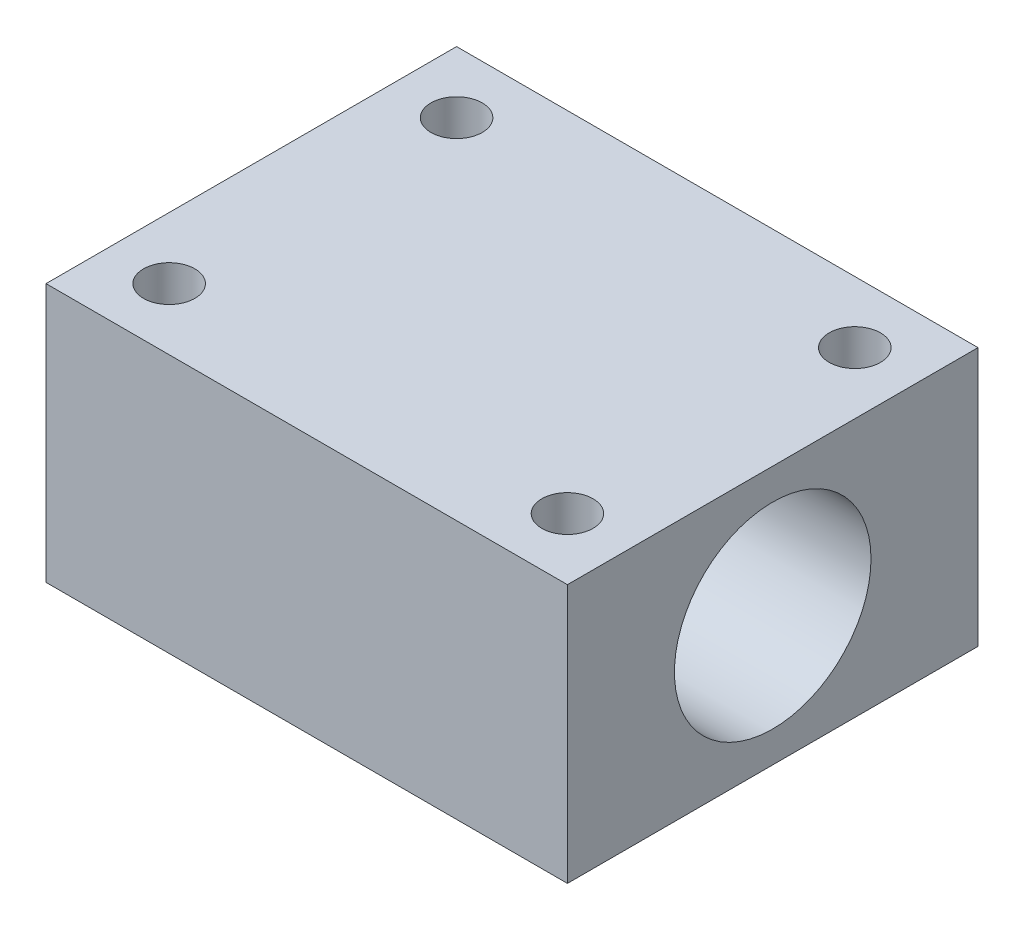
ISO-10303-21;
HEADER;
FILE_DESCRIPTION(('STEP AP214'),'2;1');
FILE_NAME('part.step','',(''),(''),'','','');
FILE_SCHEMA(('AUTOMOTIVE_DESIGN { 1 0 10303 214 1 1 1 1 }'));
ENDSEC;
DATA;
#1=APPLICATION_CONTEXT('core data for automotive mechanical design processes');
#2=APPLICATION_PROTOCOL_DEFINITION('international standard','automotive_design',2000,#1);
#3=PRODUCT_CONTEXT('',#1,'mechanical');
#4=PRODUCT('Part','Part','',(#3));
#5=PRODUCT_RELATED_PRODUCT_CATEGORY('part','',(#4));
#6=PRODUCT_DEFINITION_FORMATION('','',#4);
#7=PRODUCT_DEFINITION_CONTEXT('part definition',#1,'design');
#8=PRODUCT_DEFINITION('design','',#6,#7);
#9=PRODUCT_DEFINITION_SHAPE('','',#8);
#10=(LENGTH_UNIT() NAMED_UNIT(*) SI_UNIT(.MILLI.,.METRE.));
#11=(NAMED_UNIT(*) PLANE_ANGLE_UNIT() SI_UNIT($,.RADIAN.));
#12=(NAMED_UNIT(*) SI_UNIT($,.STERADIAN.) SOLID_ANGLE_UNIT());
#13=UNCERTAINTY_MEASURE_WITH_UNIT(LENGTH_MEASURE(1.E-05),#10,'distance_accuracy_value','');
#14=(GEOMETRIC_REPRESENTATION_CONTEXT(3) GLOBAL_UNCERTAINTY_ASSIGNED_CONTEXT((#13)) GLOBAL_UNIT_ASSIGNED_CONTEXT((#10,
#11,#12)) REPRESENTATION_CONTEXT('',''));
#15=CARTESIAN_POINT('',(0.,0.,0.));
#16=DIRECTION('',(0.,0.,1.));
#17=DIRECTION('',(1.,0.,0.));
#18=AXIS2_PLACEMENT_3D('',#15,#16,#17);
#19=CARTESIAN_POINT('',(44.998,-40.,0.));
#20=DIRECTION('',(0.,-1.,0.));
#21=DIRECTION('',(0.,0.,-1.));
#22=AXIS2_PLACEMENT_3D('',#19,#20,#21);
#23=PLANE('',#22);
#24=CARTESIAN_POINT('',(67.4,-40.,-7.));
#25=DIRECTION('',(0.,-1.,0.));
#26=DIRECTION('',(0.,0.,-1.));
#27=AXIS2_PLACEMENT_3D('',#24,#25,#26);
#28=CIRCLE('',#27,1.25);
#29=CARTESIAN_POINT('',(67.4,-40.,-8.25));
#30=VERTEX_POINT('',#29);
#31=EDGE_CURVE('E100',#30,#30,#28,.T.);
#32=ORIENTED_EDGE('',*,*,#31,.T.);
#33=EDGE_LOOP('',(#32));
#34=FACE_BOUND('',#33,.T.);
#35=CARTESIAN_POINT('',(48.,-40.,7.));
#36=DIRECTION('',(0.,-1.,0.));
#37=DIRECTION('',(0.,0.,-1.));
#38=AXIS2_PLACEMENT_3D('',#35,#36,#37);
#39=CIRCLE('',#38,1.25);
#40=CARTESIAN_POINT('',(48.,-40.,5.75));
#41=VERTEX_POINT('',#40);
#42=EDGE_CURVE('E196',#41,#41,#39,.T.);
#43=ORIENTED_EDGE('',*,*,#42,.T.);
#44=EDGE_LOOP('',(#43));
#45=FACE_BOUND('',#44,.T.);
#46=DIRECTION('',(1.,0.,0.));
#47=VECTOR('',#46,1.);
#48=CARTESIAN_POINT('',(44.998,-40.,-10.));
#49=LINE('',#48,#47);
#50=CARTESIAN_POINT('',(45.,-40.,-10.));
#51=VERTEX_POINT('',#50);
#52=CARTESIAN_POINT('',(70.4,-40.,-10.));
#53=VERTEX_POINT('',#52);
#54=EDGE_CURVE('E68',#51,#53,#49,.T.);
#55=ORIENTED_EDGE('',*,*,#54,.F.);
#56=DIRECTION('',(0.,0.,1.));
#57=VECTOR('',#56,1.);
#58=CARTESIAN_POINT('',(45.,-40.,0.));
#59=LINE('',#58,#57);
#60=CARTESIAN_POINT('',(45.,-40.,10.));
#61=VERTEX_POINT('',#60);
#62=EDGE_CURVE('E39',#51,#61,#59,.T.);
#63=ORIENTED_EDGE('',*,*,#62,.T.);
#64=DIRECTION('',(1.,0.,0.));
#65=VECTOR('',#64,1.);
#66=CARTESIAN_POINT('',(44.998,-40.,10.));
#67=LINE('',#66,#65);
#68=CARTESIAN_POINT('',(70.4,-40.,10.));
#69=VERTEX_POINT('',#68);
#70=EDGE_CURVE('E75',#61,#69,#67,.T.);
#71=ORIENTED_EDGE('',*,*,#70,.T.);
#72=DIRECTION('',(0.,0.,-1.));
#73=VECTOR('',#72,1.);
#74=CARTESIAN_POINT('',(70.4,-40.,0.));
#75=LINE('',#74,#73);
#76=EDGE_CURVE('E78',#69,#53,#75,.T.);
#77=ORIENTED_EDGE('',*,*,#76,.T.);
#78=EDGE_LOOP('',(#55,#63,#71,#77));
#79=FACE_BOUND('',#78,.T.);
#80=CARTESIAN_POINT('',(67.4,-40.,7.));
#81=DIRECTION('',(0.,-1.,0.));
#82=DIRECTION('',(0.,0.,-1.));
#83=AXIS2_PLACEMENT_3D('',#80,#81,#82);
#84=CIRCLE('',#83,1.25);
#85=CARTESIAN_POINT('',(67.4,-40.,5.75));
#86=VERTEX_POINT('',#85);
#87=EDGE_CURVE('E271',#86,#86,#84,.F.);
#88=ORIENTED_EDGE('',*,*,#87,.F.);
#89=EDGE_LOOP('',(#88));
#90=FACE_BOUND('',#89,.T.);
#91=CARTESIAN_POINT('',(48.,-40.,-7.));
#92=DIRECTION('',(0.,-1.,0.));
#93=DIRECTION('',(0.,0.,-1.));
#94=AXIS2_PLACEMENT_3D('',#91,#92,#93);
#95=CIRCLE('',#94,1.25);
#96=CARTESIAN_POINT('',(48.,-40.,-8.25));
#97=VERTEX_POINT('',#96);
#98=EDGE_CURVE('E93',#97,#97,#95,.F.);
#99=ORIENTED_EDGE('',*,*,#98,.F.);
#100=EDGE_LOOP('',(#99));
#101=FACE_BOUND('',#100,.T.);
#102=ADVANCED_FACE('F17',(#34,#45,#79,#90,#101),#23,.F.);
#103=CARTESIAN_POINT('',(44.998,-52.604,0.));
#104=DIRECTION('',(0.,1.,0.));
#105=DIRECTION('',(0.,0.,1.));
#106=AXIS2_PLACEMENT_3D('',#103,#104,#105);
#107=PLANE('',#106);
#108=CARTESIAN_POINT('',(67.4,-52.604,-7.));
#109=DIRECTION('',(0.,-1.,0.));
#110=DIRECTION('',(0.,0.,-1.));
#111=AXIS2_PLACEMENT_3D('',#108,#109,#110);
#112=CIRCLE('',#111,1.25);
#113=CARTESIAN_POINT('',(67.4,-52.604,-8.25));
#114=VERTEX_POINT('',#113);
#115=EDGE_CURVE('E202',#114,#114,#112,.T.);
#116=ORIENTED_EDGE('',*,*,#115,.F.);
#117=EDGE_LOOP('',(#116));
#118=FACE_BOUND('',#117,.T.);
#119=CARTESIAN_POINT('',(48.,-52.604,7.));
#120=DIRECTION('',(0.,-1.,0.));
#121=DIRECTION('',(0.,0.,-1.));
#122=AXIS2_PLACEMENT_3D('',#119,#120,#121);
#123=CIRCLE('',#122,1.25);
#124=CARTESIAN_POINT('',(48.,-52.604,5.75));
#125=VERTEX_POINT('',#124);
#126=EDGE_CURVE('E192',#125,#125,#123,.T.);
#127=ORIENTED_EDGE('',*,*,#126,.F.);
#128=EDGE_LOOP('',(#127));
#129=FACE_BOUND('',#128,.T.);
#130=DIRECTION('',(1.,0.,0.));
#131=VECTOR('',#130,1.);
#132=CARTESIAN_POINT('',(44.998,-52.604,10.));
#133=LINE('',#132,#131);
#134=CARTESIAN_POINT('',(45.,-52.604,10.));
#135=VERTEX_POINT('',#134);
#136=CARTESIAN_POINT('',(70.4,-52.604,10.));
#137=VERTEX_POINT('',#136);
#138=EDGE_CURVE('E115',#135,#137,#133,.T.);
#139=ORIENTED_EDGE('',*,*,#138,.F.);
#140=DIRECTION('',(0.,0.,-1.));
#141=VECTOR('',#140,1.);
#142=CARTESIAN_POINT('',(45.,-52.604,0.));
#143=LINE('',#142,#141);
#144=CARTESIAN_POINT('',(45.,-52.604,-10.));
#145=VERTEX_POINT('',#144);
#146=EDGE_CURVE('E122',#135,#145,#143,.T.);
#147=ORIENTED_EDGE('',*,*,#146,.T.);
#148=DIRECTION('',(1.,0.,0.));
#149=VECTOR('',#148,1.);
#150=CARTESIAN_POINT('',(44.998,-52.604,-10.));
#151=LINE('',#150,#149);
#152=CARTESIAN_POINT('',(70.4,-52.604,-10.));
#153=VERTEX_POINT('',#152);
#154=EDGE_CURVE('E112',#145,#153,#151,.T.);
#155=ORIENTED_EDGE('',*,*,#154,.T.);
#156=DIRECTION('',(0.,0.,1.));
#157=VECTOR('',#156,1.);
#158=CARTESIAN_POINT('',(70.4,-52.604,0.));
#159=LINE('',#158,#157);
#160=EDGE_CURVE('E91',#153,#137,#159,.T.);
#161=ORIENTED_EDGE('',*,*,#160,.T.);
#162=EDGE_LOOP('',(#139,#147,#155,#161));
#163=FACE_BOUND('',#162,.T.);
#164=CARTESIAN_POINT('',(67.4,-52.604,7.));
#165=DIRECTION('',(0.,1.,0.));
#166=DIRECTION('',(0.,0.,-1.));
#167=AXIS2_PLACEMENT_3D('',#164,#165,#166);
#168=CIRCLE('',#167,1.25);
#169=CARTESIAN_POINT('',(67.4,-52.604,5.75));
#170=VERTEX_POINT('',#169);
#171=EDGE_CURVE('E197',#170,#170,#168,.T.);
#172=ORIENTED_EDGE('',*,*,#171,.T.);
#173=EDGE_LOOP('',(#172));
#174=FACE_BOUND('',#173,.T.);
#175=CARTESIAN_POINT('',(48.,-52.604,-7.));
#176=DIRECTION('',(0.,1.,0.));
#177=DIRECTION('',(0.,0.,-1.));
#178=AXIS2_PLACEMENT_3D('',#175,#176,#177);
#179=CIRCLE('',#178,1.25);
#180=CARTESIAN_POINT('',(48.,-52.604,-8.25));
#181=VERTEX_POINT('',#180);
#182=EDGE_CURVE('E204',#181,#181,#179,.T.);
#183=ORIENTED_EDGE('',*,*,#182,.T.);
#184=EDGE_LOOP('',(#183));
#185=FACE_BOUND('',#184,.T.);
#186=ADVANCED_FACE('F163',(#118,#129,#163,#174,#185),#107,.F.);
#187=CARTESIAN_POINT('',(45.,-46.302,0.));
#188=DIRECTION('',(1.,0.,0.));
#189=DIRECTION('',(0.,1.,0.));
#190=AXIS2_PLACEMENT_3D('',#187,#188,#189);
#191=PLANE('',#190);
#192=CARTESIAN_POINT('',(45.,-46.302,0.));
#193=DIRECTION('',(1.,0.,0.));
#194=DIRECTION('',(0.,0.,-1.));
#195=AXIS2_PLACEMENT_3D('',#192,#193,#194);
#196=CIRCLE('',#195,4.7879);
#197=CARTESIAN_POINT('',(45.,-46.302,-4.7879));
#198=VERTEX_POINT('',#197);
#199=EDGE_CURVE('E74',#198,#198,#196,.F.);
#200=ORIENTED_EDGE('',*,*,#199,.F.);
#201=EDGE_LOOP('',(#200));
#202=FACE_BOUND('',#201,.T.);
#203=ORIENTED_EDGE('',*,*,#146,.F.);
#204=DIRECTION('',(0.,1.,0.));
#205=VECTOR('',#204,1.);
#206=CARTESIAN_POINT('',(45.,-46.302,10.));
#207=LINE('',#206,#205);
#208=EDGE_CURVE('E11',#135,#61,#207,.T.);
#209=ORIENTED_EDGE('',*,*,#208,.T.);
#210=ORIENTED_EDGE('',*,*,#62,.F.);
#211=DIRECTION('',(0.,1.,0.));
#212=VECTOR('',#211,1.);
#213=CARTESIAN_POINT('',(45.,-46.302,-10.));
#214=LINE('',#213,#212);
#215=EDGE_CURVE('E21',#145,#51,#214,.T.);
#216=ORIENTED_EDGE('',*,*,#215,.F.);
#217=EDGE_LOOP('',(#203,#209,#210,#216));
#218=FACE_BOUND('',#217,.T.);
#219=ADVANCED_FACE('F19',(#202,#218),#191,.F.);
#220=CARTESIAN_POINT('',(70.4,-43.802,0.));
#221=DIRECTION('',(1.,0.,0.));
#222=DIRECTION('',(0.,1.,0.));
#223=AXIS2_PLACEMENT_3D('',#220,#221,#222);
#224=PLANE('',#223);
#225=DIRECTION('',(0.,-1.,0.));
#226=VECTOR('',#225,1.);
#227=CARTESIAN_POINT('',(70.4,-46.302,-10.));
#228=LINE('',#227,#226);
#229=EDGE_CURVE('E72',#53,#153,#228,.T.);
#230=ORIENTED_EDGE('',*,*,#229,.F.);
#231=ORIENTED_EDGE('',*,*,#76,.F.);
#232=DIRECTION('',(0.,-1.,0.));
#233=VECTOR('',#232,1.);
#234=CARTESIAN_POINT('',(70.4,-46.302,10.));
#235=LINE('',#234,#233);
#236=EDGE_CURVE('E85',#69,#137,#235,.T.);
#237=ORIENTED_EDGE('',*,*,#236,.T.);
#238=ORIENTED_EDGE('',*,*,#160,.F.);
#239=EDGE_LOOP('',(#230,#231,#237,#238));
#240=FACE_BOUND('',#239,.T.);
#241=CARTESIAN_POINT('',(70.4,-46.302,0.));
#242=DIRECTION('',(1.,0.,0.));
#243=DIRECTION('',(0.,0.,-1.));
#244=AXIS2_PLACEMENT_3D('',#241,#242,#243);
#245=CIRCLE('',#244,4.7879);
#246=CARTESIAN_POINT('',(70.4,-46.302,-4.7879));
#247=VERTEX_POINT('',#246);
#248=EDGE_CURVE('E108',#247,#247,#245,.T.);
#249=ORIENTED_EDGE('',*,*,#248,.F.);
#250=EDGE_LOOP('',(#249));
#251=FACE_BOUND('',#250,.T.);
#252=ADVANCED_FACE('F88',(#240,#251),#224,.T.);
#253=CARTESIAN_POINT('',(44.998,-46.302,0.));
#254=DIRECTION('',(1.,0.,0.));
#255=DIRECTION('',(0.,0.,-1.));
#256=AXIS2_PLACEMENT_3D('',#253,#254,#255);
#257=CYLINDRICAL_SURFACE('',#256,4.7879);
#258=ORIENTED_EDGE('',*,*,#199,.T.);
#259=EDGE_LOOP('',(#258));
#260=FACE_BOUND('',#259,.T.);
#261=ORIENTED_EDGE('',*,*,#248,.T.);
#262=EDGE_LOOP('',(#261));
#263=FACE_BOUND('',#262,.T.);
#264=ADVANCED_FACE('F143',(#260,#263),#257,.F.);
#265=CARTESIAN_POINT('',(44.998,-46.302,-10.));
#266=DIRECTION('',(0.,0.,1.));
#267=DIRECTION('',(1.,0.,0.));
#268=AXIS2_PLACEMENT_3D('',#265,#266,#267);
#269=PLANE('',#268);
#270=ORIENTED_EDGE('',*,*,#154,.F.);
#271=ORIENTED_EDGE('',*,*,#215,.T.);
#272=ORIENTED_EDGE('',*,*,#54,.T.);
#273=ORIENTED_EDGE('',*,*,#229,.T.);
#274=EDGE_LOOP('',(#270,#271,#272,#273));
#275=FACE_BOUND('',#274,.T.);
#276=ADVANCED_FACE('F70',(#275),#269,.F.);
#277=CARTESIAN_POINT('',(44.998,-46.302,10.));
#278=DIRECTION('',(0.,0.,1.));
#279=DIRECTION('',(1.,0.,0.));
#280=AXIS2_PLACEMENT_3D('',#277,#278,#279);
#281=PLANE('',#280);
#282=ORIENTED_EDGE('',*,*,#208,.F.);
#283=ORIENTED_EDGE('',*,*,#138,.T.);
#284=ORIENTED_EDGE('',*,*,#236,.F.);
#285=ORIENTED_EDGE('',*,*,#70,.F.);
#286=EDGE_LOOP('',(#282,#283,#284,#285));
#287=FACE_BOUND('',#286,.T.);
#288=ADVANCED_FACE('F142',(#287),#281,.T.);
#289=CARTESIAN_POINT('',(48.,97.2700077403511,7.));
#290=DIRECTION('',(0.,-1.,0.));
#291=DIRECTION('',(0.,0.,-1.));
#292=AXIS2_PLACEMENT_3D('',#289,#290,#291);
#293=CYLINDRICAL_SURFACE('',#292,1.25);
#294=ORIENTED_EDGE('',*,*,#126,.T.);
#295=EDGE_LOOP('',(#294));
#296=FACE_BOUND('',#295,.T.);
#297=ORIENTED_EDGE('',*,*,#42,.F.);
#298=EDGE_LOOP('',(#297));
#299=FACE_BOUND('',#298,.T.);
#300=ADVANCED_FACE('F155',(#296,#299),#293,.F.);
#301=CARTESIAN_POINT('',(67.4,97.2700077403511,7.));
#302=DIRECTION('',(0.,-1.,0.));
#303=DIRECTION('',(0.,0.,-1.));
#304=AXIS2_PLACEMENT_3D('',#301,#302,#303);
#305=CYLINDRICAL_SURFACE('',#304,1.25);
#306=ORIENTED_EDGE('',*,*,#171,.F.);
#307=EDGE_LOOP('',(#306));
#308=FACE_BOUND('',#307,.T.);
#309=ORIENTED_EDGE('',*,*,#87,.T.);
#310=EDGE_LOOP('',(#309));
#311=FACE_BOUND('',#310,.T.);
#312=ADVANCED_FACE('F233',(#308,#311),#305,.F.);
#313=CARTESIAN_POINT('',(67.4,97.2700077403511,-7.));
#314=DIRECTION('',(0.,-1.,0.));
#315=DIRECTION('',(0.,0.,-1.));
#316=AXIS2_PLACEMENT_3D('',#313,#314,#315);
#317=CYLINDRICAL_SURFACE('',#316,1.25);
#318=ORIENTED_EDGE('',*,*,#115,.T.);
#319=EDGE_LOOP('',(#318));
#320=FACE_BOUND('',#319,.T.);
#321=ORIENTED_EDGE('',*,*,#31,.F.);
#322=EDGE_LOOP('',(#321));
#323=FACE_BOUND('',#322,.T.);
#324=ADVANCED_FACE('F243',(#320,#323),#317,.F.);
#325=CARTESIAN_POINT('',(48.,97.2700077403511,-7.));
#326=DIRECTION('',(0.,-1.,0.));
#327=DIRECTION('',(0.,0.,-1.));
#328=AXIS2_PLACEMENT_3D('',#325,#326,#327);
#329=CYLINDRICAL_SURFACE('',#328,1.25);
#330=ORIENTED_EDGE('',*,*,#182,.F.);
#331=EDGE_LOOP('',(#330));
#332=FACE_BOUND('',#331,.T.);
#333=ORIENTED_EDGE('',*,*,#98,.T.);
#334=EDGE_LOOP('',(#333));
#335=FACE_BOUND('',#334,.T.);
#336=ADVANCED_FACE('F250',(#332,#335),#329,.F.);
#337=CLOSED_SHELL('',(#102,#186,#219,#252,#264,#276,#288,#300,#312,#324,#336));
#338=MANIFOLD_SOLID_BREP('B1',#337);
#339=ADVANCED_BREP_SHAPE_REPRESENTATION('',(#18,#338),#14);
#340=SHAPE_DEFINITION_REPRESENTATION(#9,#339);
ENDSEC;
END-ISO-10303-21;
